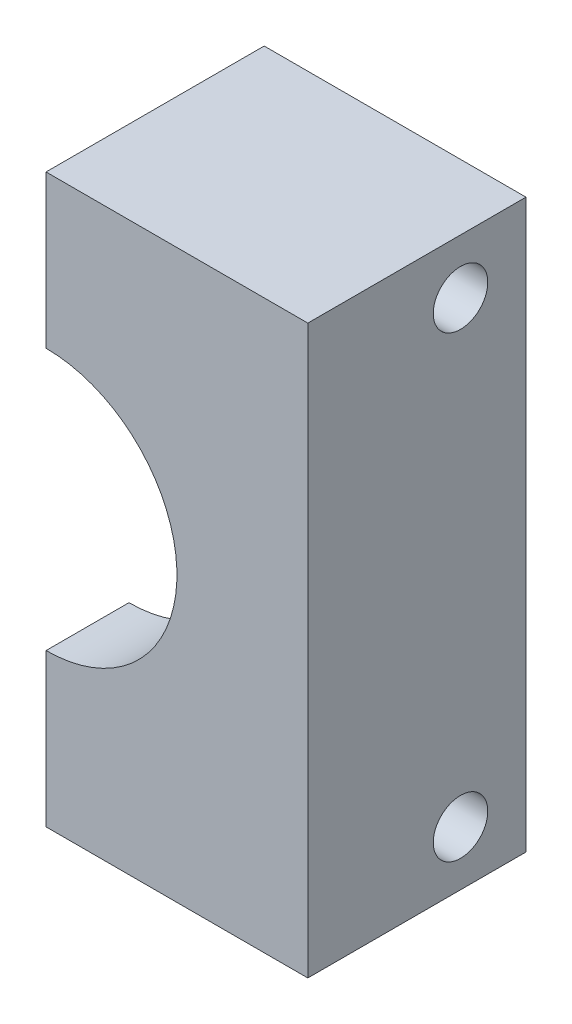
ISO-10303-21;
HEADER;
FILE_DESCRIPTION(('STEP AP214'),'2;1');
FILE_NAME('part.step','',(''),(''),'','','');
FILE_SCHEMA(('AUTOMOTIVE_DESIGN { 1 0 10303 214 1 1 1 1 }'));
ENDSEC;
DATA;
#1=APPLICATION_CONTEXT('core data for automotive mechanical design processes');
#2=APPLICATION_PROTOCOL_DEFINITION('international standard','automotive_design',2000,#1);
#3=PRODUCT_CONTEXT('',#1,'mechanical');
#4=PRODUCT('Part','Part','',(#3));
#5=PRODUCT_RELATED_PRODUCT_CATEGORY('part','',(#4));
#6=PRODUCT_DEFINITION_FORMATION('','',#4);
#7=PRODUCT_DEFINITION_CONTEXT('part definition',#1,'design');
#8=PRODUCT_DEFINITION('design','',#6,#7);
#9=PRODUCT_DEFINITION_SHAPE('','',#8);
#10=(LENGTH_UNIT() NAMED_UNIT(*) SI_UNIT(.MILLI.,.METRE.));
#11=(NAMED_UNIT(*) PLANE_ANGLE_UNIT() SI_UNIT($,.RADIAN.));
#12=(NAMED_UNIT(*) SI_UNIT($,.STERADIAN.) SOLID_ANGLE_UNIT());
#13=UNCERTAINTY_MEASURE_WITH_UNIT(LENGTH_MEASURE(1.E-05),#10,'distance_accuracy_value','');
#14=(GEOMETRIC_REPRESENTATION_CONTEXT(3) GLOBAL_UNCERTAINTY_ASSIGNED_CONTEXT((#13)) GLOBAL_UNIT_ASSIGNED_CONTEXT((#10,
#11,#12)) REPRESENTATION_CONTEXT('',''));
#15=CARTESIAN_POINT('',(0.,0.,0.));
#16=DIRECTION('',(0.,0.,1.));
#17=DIRECTION('',(1.,0.,0.));
#18=AXIS2_PLACEMENT_3D('',#15,#16,#17);
#19=CARTESIAN_POINT('',(-12.,13.,10.));
#20=DIRECTION('',(0.,0.,-1.));
#21=DIRECTION('',(-1.,0.,0.));
#22=AXIS2_PLACEMENT_3D('',#19,#20,#21);
#23=CYLINDRICAL_SURFACE('',#22,8.);
#24=DIRECTION('',(0.,0.,-1.));
#25=VECTOR('',#24,1.);
#26=CARTESIAN_POINT('',(-12.,5.,10.));
#27=LINE('',#26,#25);
#28=CARTESIAN_POINT('',(-12.,5.,6.2));
#29=VERTEX_POINT('',#28);
#30=CARTESIAN_POINT('',(-12.,5.,0.));
#31=VERTEX_POINT('',#30);
#32=EDGE_CURVE('E11',#29,#31,#27,.T.);
#33=ORIENTED_EDGE('',*,*,#32,.F.);
#34=CARTESIAN_POINT('',(-12.,13.,6.2));
#35=DIRECTION('',(0.,0.,1.));
#36=DIRECTION('',(1.,0.,0.));
#37=AXIS2_PLACEMENT_3D('',#34,#35,#36);
#38=CIRCLE('',#37,8.);
#39=CARTESIAN_POINT('',(-12.,21.,6.2));
#40=VERTEX_POINT('',#39);
#41=EDGE_CURVE('E51',#40,#29,#38,.F.);
#42=ORIENTED_EDGE('',*,*,#41,.F.);
#43=DIRECTION('',(0.,0.,-1.));
#44=VECTOR('',#43,1.);
#45=CARTESIAN_POINT('',(-12.,21.,10.));
#46=LINE('',#45,#44);
#47=CARTESIAN_POINT('',(-12.,21.,0.));
#48=VERTEX_POINT('',#47);
#49=EDGE_CURVE('E125',#40,#48,#46,.T.);
#50=ORIENTED_EDGE('',*,*,#49,.T.);
#51=CARTESIAN_POINT('',(-12.,13.,0.));
#52=DIRECTION('',(0.,0.,1.));
#53=DIRECTION('',(1.,0.,0.));
#54=AXIS2_PLACEMENT_3D('',#51,#52,#53);
#55=CIRCLE('',#54,8.);
#56=EDGE_CURVE('E154',#31,#48,#55,.T.);
#57=ORIENTED_EDGE('',*,*,#56,.F.);
#58=EDGE_LOOP('',(#33,#42,#50,#57));
#59=FACE_BOUND('',#58,.T.);
#60=ADVANCED_FACE('F35',(#59),#23,.F.);
#61=CARTESIAN_POINT('',(-12.,0.,10.));
#62=DIRECTION('',(-1.,0.,0.));
#63=DIRECTION('',(0.,0.,1.));
#64=AXIS2_PLACEMENT_3D('',#61,#62,#63);
#65=PLANE('',#64);
#66=CARTESIAN_POINT('',(-12.,2.5,3.));
#67=DIRECTION('',(-1.,0.,0.));
#68=DIRECTION('',(0.,0.,1.));
#69=AXIS2_PLACEMENT_3D('',#66,#67,#68);
#70=CIRCLE('',#69,1.25);
#71=CARTESIAN_POINT('',(-12.,2.5,4.25));
#72=VERTEX_POINT('',#71);
#73=EDGE_CURVE('E178',#72,#72,#70,.T.);
#74=ORIENTED_EDGE('',*,*,#73,.F.);
#75=EDGE_LOOP('',(#74));
#76=FACE_BOUND('',#75,.T.);
#77=DIRECTION('',(0.,1.,0.));
#78=VECTOR('',#77,1.);
#79=CARTESIAN_POINT('',(-12.,0.,0.));
#80=LINE('',#79,#78);
#81=CARTESIAN_POINT('',(-12.,0.,0.));
#82=VERTEX_POINT('',#81);
#83=EDGE_CURVE('E152',#82,#31,#80,.T.);
#84=ORIENTED_EDGE('',*,*,#83,.F.);
#85=DIRECTION('',(0.,0.,-1.));
#86=VECTOR('',#85,1.);
#87=CARTESIAN_POINT('',(-12.,0.,10.));
#88=LINE('',#87,#86);
#89=CARTESIAN_POINT('',(-12.,0.,10.));
#90=VERTEX_POINT('',#89);
#91=EDGE_CURVE('E42',#90,#82,#88,.T.);
#92=ORIENTED_EDGE('',*,*,#91,.F.);
#93=DIRECTION('',(0.,1.,0.));
#94=VECTOR('',#93,1.);
#95=CARTESIAN_POINT('',(-12.,0.,10.));
#96=LINE('',#95,#94);
#97=CARTESIAN_POINT('',(-12.,7.,10.));
#98=VERTEX_POINT('',#97);
#99=EDGE_CURVE('E102',#90,#98,#96,.T.);
#100=ORIENTED_EDGE('',*,*,#99,.T.);
#101=DIRECTION('',(0.,0.,1.));
#102=VECTOR('',#101,1.);
#103=CARTESIAN_POINT('',(-12.,7.,6.2));
#104=LINE('',#103,#102);
#105=CARTESIAN_POINT('',(-12.,7.,6.2));
#106=VERTEX_POINT('',#105);
#107=EDGE_CURVE('E95',#106,#98,#104,.T.);
#108=ORIENTED_EDGE('',*,*,#107,.F.);
#109=DIRECTION('',(0.,-1.,0.));
#110=VECTOR('',#109,1.);
#111=CARTESIAN_POINT('',(-12.,0.,6.2));
#112=LINE('',#111,#110);
#113=EDGE_CURVE('E100',#106,#29,#112,.T.);
#114=ORIENTED_EDGE('',*,*,#113,.T.);
#115=ORIENTED_EDGE('',*,*,#32,.T.);
#116=EDGE_LOOP('',(#84,#92,#100,#108,#114,#115));
#117=FACE_BOUND('',#116,.T.);
#118=ADVANCED_FACE('F98',(#76,#117),#65,.T.);
#119=CARTESIAN_POINT('',(0.,0.,10.));
#120=DIRECTION('',(0.,-1.,0.));
#121=DIRECTION('',(1.,0.,0.));
#122=AXIS2_PLACEMENT_3D('',#119,#120,#121);
#123=PLANE('',#122);
#124=DIRECTION('',(-1.,0.,0.));
#125=VECTOR('',#124,1.);
#126=CARTESIAN_POINT('',(0.,0.,0.));
#127=LINE('',#126,#125);
#128=CARTESIAN_POINT('',(0.,0.,0.));
#129=VERTEX_POINT('',#128);
#130=EDGE_CURVE('E148',#129,#82,#127,.T.);
#131=ORIENTED_EDGE('',*,*,#130,.F.);
#132=DIRECTION('',(0.,0.,-1.));
#133=VECTOR('',#132,1.);
#134=CARTESIAN_POINT('',(0.,0.,10.));
#135=LINE('',#134,#133);
#136=CARTESIAN_POINT('',(0.,0.,10.));
#137=VERTEX_POINT('',#136);
#138=EDGE_CURVE('E142',#137,#129,#135,.T.);
#139=ORIENTED_EDGE('',*,*,#138,.F.);
#140=DIRECTION('',(-1.,0.,0.));
#141=VECTOR('',#140,1.);
#142=CARTESIAN_POINT('',(0.,0.,10.));
#143=LINE('',#142,#141);
#144=EDGE_CURVE('E150',#137,#90,#143,.T.);
#145=ORIENTED_EDGE('',*,*,#144,.T.);
#146=ORIENTED_EDGE('',*,*,#91,.T.);
#147=EDGE_LOOP('',(#131,#139,#145,#146));
#148=FACE_BOUND('',#147,.T.);
#149=ADVANCED_FACE('F146',(#148),#123,.T.);
#150=CARTESIAN_POINT('',(0.,0.,10.));
#151=DIRECTION('',(-1.,0.,0.));
#152=DIRECTION('',(0.,0.,1.));
#153=AXIS2_PLACEMENT_3D('',#150,#151,#152);
#154=PLANE('',#153);
#155=CARTESIAN_POINT('',(0.,2.5,3.));
#156=DIRECTION('',(-1.,0.,0.));
#157=DIRECTION('',(0.,0.,1.));
#158=AXIS2_PLACEMENT_3D('',#155,#156,#157);
#159=CIRCLE('',#158,1.25);
#160=CARTESIAN_POINT('',(0.,2.5,4.25));
#161=VERTEX_POINT('',#160);
#162=EDGE_CURVE('E175',#161,#161,#159,.T.);
#163=ORIENTED_EDGE('',*,*,#162,.T.);
#164=EDGE_LOOP('',(#163));
#165=FACE_BOUND('',#164,.T.);
#166=CARTESIAN_POINT('',(0.,23.5,3.));
#167=DIRECTION('',(-1.,0.,0.));
#168=DIRECTION('',(0.,0.,1.));
#169=AXIS2_PLACEMENT_3D('',#166,#167,#168);
#170=CIRCLE('',#169,1.25);
#171=CARTESIAN_POINT('',(0.,23.5,4.25));
#172=VERTEX_POINT('',#171);
#173=EDGE_CURVE('E168',#172,#172,#170,.T.);
#174=ORIENTED_EDGE('',*,*,#173,.T.);
#175=EDGE_LOOP('',(#174));
#176=FACE_BOUND('',#175,.T.);
#177=DIRECTION('',(0.,1.,0.));
#178=VECTOR('',#177,1.);
#179=CARTESIAN_POINT('',(0.,0.,0.));
#180=LINE('',#179,#178);
#181=CARTESIAN_POINT('',(0.,26.,0.));
#182=VERTEX_POINT('',#181);
#183=EDGE_CURVE('E159',#129,#182,#180,.T.);
#184=ORIENTED_EDGE('',*,*,#183,.T.);
#185=DIRECTION('',(0.,0.,-1.));
#186=VECTOR('',#185,1.);
#187=CARTESIAN_POINT('',(0.,26.,10.));
#188=LINE('',#187,#186);
#189=CARTESIAN_POINT('',(0.,26.,10.));
#190=VERTEX_POINT('',#189);
#191=EDGE_CURVE('E132',#190,#182,#188,.T.);
#192=ORIENTED_EDGE('',*,*,#191,.F.);
#193=DIRECTION('',(0.,1.,0.));
#194=VECTOR('',#193,1.);
#195=CARTESIAN_POINT('',(0.,0.,10.));
#196=LINE('',#195,#194);
#197=EDGE_CURVE('E164',#137,#190,#196,.T.);
#198=ORIENTED_EDGE('',*,*,#197,.F.);
#199=ORIENTED_EDGE('',*,*,#138,.T.);
#200=EDGE_LOOP('',(#184,#192,#198,#199));
#201=FACE_BOUND('',#200,.T.);
#202=ADVANCED_FACE('F184',(#165,#176,#201),#154,.F.);
#203=CARTESIAN_POINT('',(0.,26.,10.));
#204=DIRECTION('',(0.,-1.,0.));
#205=DIRECTION('',(0.,0.,-1.));
#206=AXIS2_PLACEMENT_3D('',#203,#204,#205);
#207=PLANE('',#206);
#208=DIRECTION('',(-1.,0.,0.));
#209=VECTOR('',#208,1.);
#210=CARTESIAN_POINT('',(0.,26.,0.));
#211=LINE('',#210,#209);
#212=CARTESIAN_POINT('',(-12.,26.,0.));
#213=VERTEX_POINT('',#212);
#214=EDGE_CURVE('E137',#182,#213,#211,.T.);
#215=ORIENTED_EDGE('',*,*,#214,.T.);
#216=DIRECTION('',(0.,0.,-1.));
#217=VECTOR('',#216,1.);
#218=CARTESIAN_POINT('',(-12.,26.,10.));
#219=LINE('',#218,#217);
#220=CARTESIAN_POINT('',(-12.,26.,10.));
#221=VERTEX_POINT('',#220);
#222=EDGE_CURVE('E129',#221,#213,#219,.T.);
#223=ORIENTED_EDGE('',*,*,#222,.F.);
#224=DIRECTION('',(-1.,0.,0.));
#225=VECTOR('',#224,1.);
#226=CARTESIAN_POINT('',(0.,26.,10.));
#227=LINE('',#226,#225);
#228=EDGE_CURVE('E134',#190,#221,#227,.T.);
#229=ORIENTED_EDGE('',*,*,#228,.F.);
#230=ORIENTED_EDGE('',*,*,#191,.T.);
#231=EDGE_LOOP('',(#215,#223,#229,#230));
#232=FACE_BOUND('',#231,.T.);
#233=ADVANCED_FACE('F203',(#232),#207,.F.);
#234=CARTESIAN_POINT('',(-12.,23.5,3.));
#235=DIRECTION('',(-1.,0.,0.));
#236=DIRECTION('',(0.,0.,1.));
#237=AXIS2_PLACEMENT_3D('',#234,#235,#236);
#238=CIRCLE('',#237,1.25);
#239=CARTESIAN_POINT('',(-12.,23.5,4.25));
#240=VERTEX_POINT('',#239);
#241=EDGE_CURVE('E170',#240,#240,#238,.T.);
#242=ORIENTED_EDGE('',*,*,#241,.F.);
#243=EDGE_LOOP('',(#242));
#244=FACE_BOUND('',#243,.T.);
#245=EDGE_CURVE('E127',#48,#213,#80,.T.);
#246=ORIENTED_EDGE('',*,*,#245,.F.);
#247=ORIENTED_EDGE('',*,*,#49,.F.);
#248=CARTESIAN_POINT('',(-12.,19.,6.2));
#249=VERTEX_POINT('',#248);
#250=EDGE_CURVE('E107',#40,#249,#112,.T.);
#251=ORIENTED_EDGE('',*,*,#250,.T.);
#252=DIRECTION('',(0.,0.,1.));
#253=VECTOR('',#252,1.);
#254=CARTESIAN_POINT('',(-12.,19.,6.2));
#255=LINE('',#254,#253);
#256=CARTESIAN_POINT('',(-12.,19.,10.));
#257=VERTEX_POINT('',#256);
#258=EDGE_CURVE('E106',#249,#257,#255,.T.);
#259=ORIENTED_EDGE('',*,*,#258,.T.);
#260=EDGE_CURVE('E130',#257,#221,#96,.T.);
#261=ORIENTED_EDGE('',*,*,#260,.T.);
#262=ORIENTED_EDGE('',*,*,#222,.T.);
#263=EDGE_LOOP('',(#246,#247,#251,#259,#261,#262));
#264=FACE_BOUND('',#263,.T.);
#265=ADVANCED_FACE('F123',(#244,#264),#65,.T.);
#266=CARTESIAN_POINT('',(0.,0.,10.));
#267=DIRECTION('',(0.,0.,1.));
#268=DIRECTION('',(1.,0.,0.));
#269=AXIS2_PLACEMENT_3D('',#266,#267,#268);
#270=PLANE('',#269);
#271=ORIENTED_EDGE('',*,*,#260,.F.);
#272=CARTESIAN_POINT('',(-12.,13.,10.));
#273=DIRECTION('',(0.,0.,1.));
#274=DIRECTION('',(1.,0.,0.));
#275=AXIS2_PLACEMENT_3D('',#272,#273,#274);
#276=CIRCLE('',#275,6.);
#277=EDGE_CURVE('E116',#98,#257,#276,.T.);
#278=ORIENTED_EDGE('',*,*,#277,.F.);
#279=ORIENTED_EDGE('',*,*,#99,.F.);
#280=ORIENTED_EDGE('',*,*,#144,.F.);
#281=ORIENTED_EDGE('',*,*,#197,.T.);
#282=ORIENTED_EDGE('',*,*,#228,.T.);
#283=EDGE_LOOP('',(#271,#278,#279,#280,#281,#282));
#284=FACE_BOUND('',#283,.T.);
#285=ADVANCED_FACE('F202',(#284),#270,.T.);
#286=CARTESIAN_POINT('',(0.,0.,0.));
#287=DIRECTION('',(0.,0.,1.));
#288=DIRECTION('',(1.,0.,0.));
#289=AXIS2_PLACEMENT_3D('',#286,#287,#288);
#290=PLANE('',#289);
#291=ORIENTED_EDGE('',*,*,#56,.T.);
#292=ORIENTED_EDGE('',*,*,#245,.T.);
#293=ORIENTED_EDGE('',*,*,#214,.F.);
#294=ORIENTED_EDGE('',*,*,#183,.F.);
#295=ORIENTED_EDGE('',*,*,#130,.T.);
#296=ORIENTED_EDGE('',*,*,#83,.T.);
#297=EDGE_LOOP('',(#291,#292,#293,#294,#295,#296));
#298=FACE_BOUND('',#297,.T.);
#299=ADVANCED_FACE('F157',(#298),#290,.F.);
#300=CARTESIAN_POINT('',(-12.,13.,6.2));
#301=DIRECTION('',(0.,0.,1.));
#302=DIRECTION('',(1.,0.,0.));
#303=AXIS2_PLACEMENT_3D('',#300,#301,#302);
#304=CYLINDRICAL_SURFACE('',#303,6.);
#305=ORIENTED_EDGE('',*,*,#277,.T.);
#306=ORIENTED_EDGE('',*,*,#258,.F.);
#307=CARTESIAN_POINT('',(-12.,13.,6.2));
#308=DIRECTION('',(0.,0.,1.));
#309=DIRECTION('',(1.,0.,0.));
#310=AXIS2_PLACEMENT_3D('',#307,#308,#309);
#311=CIRCLE('',#310,6.);
#312=EDGE_CURVE('E110',#106,#249,#311,.T.);
#313=ORIENTED_EDGE('',*,*,#312,.F.);
#314=ORIENTED_EDGE('',*,*,#107,.T.);
#315=EDGE_LOOP('',(#305,#306,#313,#314));
#316=FACE_BOUND('',#315,.T.);
#317=ADVANCED_FACE('F111',(#316),#304,.F.);
#318=CARTESIAN_POINT('',(0.,0.,6.2));
#319=DIRECTION('',(0.,0.,1.));
#320=DIRECTION('',(1.,0.,0.));
#321=AXIS2_PLACEMENT_3D('',#318,#319,#320);
#322=PLANE('',#321);
#323=ORIENTED_EDGE('',*,*,#312,.T.);
#324=ORIENTED_EDGE('',*,*,#250,.F.);
#325=ORIENTED_EDGE('',*,*,#41,.T.);
#326=ORIENTED_EDGE('',*,*,#113,.F.);
#327=EDGE_LOOP('',(#323,#324,#325,#326));
#328=FACE_BOUND('',#327,.T.);
#329=ADVANCED_FACE('F118',(#328),#322,.F.);
#330=CARTESIAN_POINT('',(0.,23.5,3.));
#331=DIRECTION('',(-1.,0.,0.));
#332=DIRECTION('',(0.,0.,1.));
#333=AXIS2_PLACEMENT_3D('',#330,#331,#332);
#334=CYLINDRICAL_SURFACE('',#333,1.25);
#335=ORIENTED_EDGE('',*,*,#173,.F.);
#336=EDGE_LOOP('',(#335));
#337=FACE_BOUND('',#336,.T.);
#338=ORIENTED_EDGE('',*,*,#241,.T.);
#339=EDGE_LOOP('',(#338));
#340=FACE_BOUND('',#339,.T.);
#341=ADVANCED_FACE('F189',(#337,#340),#334,.F.);
#342=CARTESIAN_POINT('',(0.,2.5,3.));
#343=DIRECTION('',(-1.,0.,0.));
#344=DIRECTION('',(0.,0.,1.));
#345=AXIS2_PLACEMENT_3D('',#342,#343,#344);
#346=CYLINDRICAL_SURFACE('',#345,1.25);
#347=ORIENTED_EDGE('',*,*,#162,.F.);
#348=EDGE_LOOP('',(#347));
#349=FACE_BOUND('',#348,.T.);
#350=ORIENTED_EDGE('',*,*,#73,.T.);
#351=EDGE_LOOP('',(#350));
#352=FACE_BOUND('',#351,.T.);
#353=ADVANCED_FACE('F186',(#349,#352),#346,.F.);
#354=CLOSED_SHELL('',(#60,#118,#149,#202,#233,#265,#285,#299,#317,#329,#341,#353));
#355=MANIFOLD_SOLID_BREP('B2',#354);
#356=ADVANCED_BREP_SHAPE_REPRESENTATION('',(#18,#355),#14);
#357=SHAPE_DEFINITION_REPRESENTATION(#9,#356);
ENDSEC;
END-ISO-10303-21;
